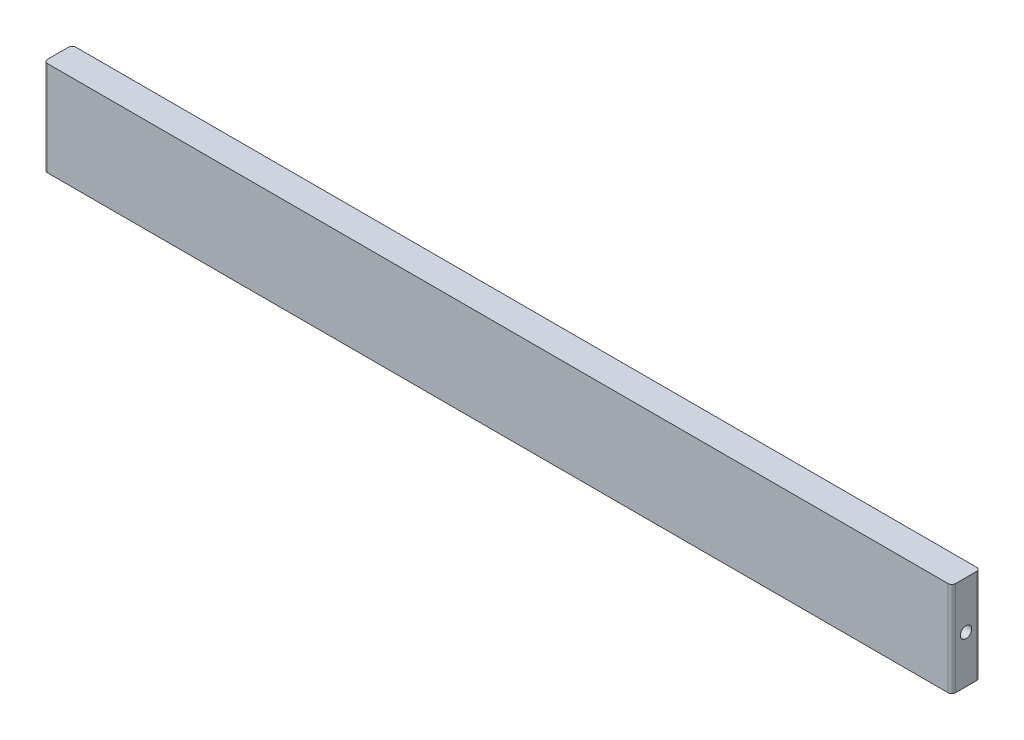
ISO-10303-21;
HEADER;
FILE_DESCRIPTION(('STEP AP214'),'2;1');
FILE_NAME('part.step','',(''),(''),'','','');
FILE_SCHEMA(('AUTOMOTIVE_DESIGN { 1 0 10303 214 1 1 1 1 }'));
ENDSEC;
DATA;
#1=APPLICATION_CONTEXT('core data for automotive mechanical design processes');
#2=APPLICATION_PROTOCOL_DEFINITION('international standard','automotive_design',2000,#1);
#3=PRODUCT_CONTEXT('',#1,'mechanical');
#4=PRODUCT('Part','Part','',(#3));
#5=PRODUCT_RELATED_PRODUCT_CATEGORY('part','',(#4));
#6=PRODUCT_DEFINITION_FORMATION('','',#4);
#7=PRODUCT_DEFINITION_CONTEXT('part definition',#1,'design');
#8=PRODUCT_DEFINITION('design','',#6,#7);
#9=PRODUCT_DEFINITION_SHAPE('','',#8);
#10=(LENGTH_UNIT() NAMED_UNIT(*) SI_UNIT(.MILLI.,.METRE.));
#11=(NAMED_UNIT(*) PLANE_ANGLE_UNIT() SI_UNIT($,.RADIAN.));
#12=(NAMED_UNIT(*) SI_UNIT($,.STERADIAN.) SOLID_ANGLE_UNIT());
#13=UNCERTAINTY_MEASURE_WITH_UNIT(LENGTH_MEASURE(1.E-05),#10,'distance_accuracy_value','');
#14=(GEOMETRIC_REPRESENTATION_CONTEXT(3) GLOBAL_UNCERTAINTY_ASSIGNED_CONTEXT((#13)) GLOBAL_UNIT_ASSIGNED_CONTEXT((#10,
#11,#12)) REPRESENTATION_CONTEXT('',''));
#15=CARTESIAN_POINT('',(0.,0.,0.));
#16=DIRECTION('',(0.,0.,1.));
#17=DIRECTION('',(1.,0.,0.));
#18=AXIS2_PLACEMENT_3D('',#15,#16,#17);
#19=CARTESIAN_POINT('',(0.,10.75,170.));
#20=DIRECTION('',(0.,0.,-1.));
#21=DIRECTION('',(-1.,0.,0.));
#22=AXIS2_PLACEMENT_3D('',#19,#20,#21);
#23=PLANE('',#22);
#24=DIRECTION('',(1.,0.,0.));
#25=VECTOR('',#24,1.);
#26=CARTESIAN_POINT('',(0.,10.75,170.));
#27=LINE('',#26,#25);
#28=CARTESIAN_POINT('',(-151.129999330971,10.75,170.));
#29=VERTEX_POINT('',#28);
#30=CARTESIAN_POINT('',(151.13000066903,10.75,170.));
#31=VERTEX_POINT('',#30);
#32=EDGE_CURVE('E228',#29,#31,#27,.T.);
#33=ORIENTED_EDGE('',*,*,#32,.T.);
#34=DIRECTION('',(0.,-1.,0.));
#35=VECTOR('',#34,1.);
#36=CARTESIAN_POINT('',(151.13000066903,-21.,170.));
#37=LINE('',#36,#35);
#38=CARTESIAN_POINT('',(151.13000066903,-21.,170.));
#39=VERTEX_POINT('',#38);
#40=EDGE_CURVE('E250',#31,#39,#37,.T.);
#41=ORIENTED_EDGE('',*,*,#40,.T.);
#42=DIRECTION('',(1.,0.,0.));
#43=VECTOR('',#42,1.);
#44=CARTESIAN_POINT('',(0.,-21.,170.));
#45=LINE('',#44,#43);
#46=CARTESIAN_POINT('',(-151.129999330971,-21.,170.));
#47=VERTEX_POINT('',#46);
#48=EDGE_CURVE('E227',#47,#39,#45,.T.);
#49=ORIENTED_EDGE('',*,*,#48,.F.);
#50=DIRECTION('',(0.,-1.,0.));
#51=VECTOR('',#50,1.);
#52=CARTESIAN_POINT('',(-151.129999330971,10.75,170.));
#53=LINE('',#52,#51);
#54=EDGE_CURVE('E239',#47,#29,#53,.F.);
#55=ORIENTED_EDGE('',*,*,#54,.T.);
#56=EDGE_LOOP('',(#33,#41,#49,#55));
#57=FACE_BOUND('',#56,.T.);
#58=ADVANCED_FACE('F99',(#57),#23,.T.);
#59=CARTESIAN_POINT('',(-152.39999933097,10.75,0.));
#60=DIRECTION('',(1.,0.,0.));
#61=DIRECTION('',(0.,0.,-1.));
#62=AXIS2_PLACEMENT_3D('',#59,#60,#61);
#63=PLANE('',#62);
#64=CARTESIAN_POINT('',(-152.40000066903,-5.12499999999997,174.7625));
#65=DIRECTION('',(-1.,0.,0.));
#66=DIRECTION('',(0.,0.,1.));
#67=AXIS2_PLACEMENT_3D('',#64,#65,#66);
#68=CIRCLE('',#67,1.89864999999999);
#69=CARTESIAN_POINT('',(-152.40000066903,-5.12499999999997,176.66115));
#70=VERTEX_POINT('',#69);
#71=EDGE_CURVE('E193',#70,#70,#68,.T.);
#72=ORIENTED_EDGE('',*,*,#71,.F.);
#73=EDGE_LOOP('',(#72));
#74=FACE_BOUND('',#73,.T.);
#75=DIRECTION('',(0.,0.,1.));
#76=VECTOR('',#75,1.);
#77=CARTESIAN_POINT('',(-152.39999933097,10.75,0.));
#78=LINE('',#77,#76);
#79=CARTESIAN_POINT('',(-152.399999330971,10.75,171.27));
#80=VERTEX_POINT('',#79);
#81=CARTESIAN_POINT('',(-152.399999330971,10.75,178.255));
#82=VERTEX_POINT('',#81);
#83=EDGE_CURVE('E231',#80,#82,#78,.T.);
#84=ORIENTED_EDGE('',*,*,#83,.F.);
#85=DIRECTION('',(0.,-1.,0.));
#86=VECTOR('',#85,1.);
#87=CARTESIAN_POINT('',(-152.399999330971,-21.,171.27));
#88=LINE('',#87,#86);
#89=CARTESIAN_POINT('',(-152.399999330971,-21.,171.27));
#90=VERTEX_POINT('',#89);
#91=EDGE_CURVE('E12',#80,#90,#88,.T.);
#92=ORIENTED_EDGE('',*,*,#91,.T.);
#93=DIRECTION('',(0.,0.,1.));
#94=VECTOR('',#93,1.);
#95=CARTESIAN_POINT('',(-152.39999933097,-21.,0.));
#96=LINE('',#95,#94);
#97=CARTESIAN_POINT('',(-152.399999330971,-21.,178.255));
#98=VERTEX_POINT('',#97);
#99=EDGE_CURVE('E242',#90,#98,#96,.T.);
#100=ORIENTED_EDGE('',*,*,#99,.T.);
#101=DIRECTION('',(0.,-1.,0.));
#102=VECTOR('',#101,1.);
#103=CARTESIAN_POINT('',(-152.399999330971,10.75,178.255));
#104=LINE('',#103,#102);
#105=EDGE_CURVE('E107',#98,#82,#104,.F.);
#106=ORIENTED_EDGE('',*,*,#105,.T.);
#107=EDGE_LOOP('',(#84,#92,#100,#106));
#108=FACE_BOUND('',#107,.T.);
#109=ADVANCED_FACE('F279',(#74,#108),#63,.F.);
#110=CARTESIAN_POINT('',(0.,10.75,179.525));
#111=DIRECTION('',(0.,0.,-1.));
#112=DIRECTION('',(-1.,0.,0.));
#113=AXIS2_PLACEMENT_3D('',#110,#111,#112);
#114=PLANE('',#113);
#115=DIRECTION('',(1.,0.,0.));
#116=VECTOR('',#115,1.);
#117=CARTESIAN_POINT('',(0.,-21.,179.525));
#118=LINE('',#117,#116);
#119=CARTESIAN_POINT('',(-151.129999330971,-21.,179.525));
#120=VERTEX_POINT('',#119);
#121=CARTESIAN_POINT('',(151.13000066903,-21.,179.525));
#122=VERTEX_POINT('',#121);
#123=EDGE_CURVE('E245',#120,#122,#118,.T.);
#124=ORIENTED_EDGE('',*,*,#123,.T.);
#125=DIRECTION('',(0.,-1.,0.));
#126=VECTOR('',#125,1.);
#127=CARTESIAN_POINT('',(151.13000066903,10.75,179.525));
#128=LINE('',#127,#126);
#129=CARTESIAN_POINT('',(151.13000066903,10.75,179.525));
#130=VERTEX_POINT('',#129);
#131=EDGE_CURVE('E114',#122,#130,#128,.F.);
#132=ORIENTED_EDGE('',*,*,#131,.T.);
#133=DIRECTION('',(1.,0.,0.));
#134=VECTOR('',#133,1.);
#135=CARTESIAN_POINT('',(0.,10.75,179.525));
#136=LINE('',#135,#134);
#137=CARTESIAN_POINT('',(-151.129999330971,10.75,179.525));
#138=VERTEX_POINT('',#137);
#139=EDGE_CURVE('E234',#138,#130,#136,.T.);
#140=ORIENTED_EDGE('',*,*,#139,.F.);
#141=DIRECTION('',(0.,-1.,0.));
#142=VECTOR('',#141,1.);
#143=CARTESIAN_POINT('',(-151.129999330971,10.75,179.525));
#144=LINE('',#143,#142);
#145=EDGE_CURVE('E273',#138,#120,#144,.T.);
#146=ORIENTED_EDGE('',*,*,#145,.T.);
#147=EDGE_LOOP('',(#124,#132,#140,#146));
#148=FACE_BOUND('',#147,.T.);
#149=ADVANCED_FACE('F288',(#148),#114,.F.);
#150=CARTESIAN_POINT('',(152.40000066903,10.75,0.));
#151=DIRECTION('',(-1.,0.,0.));
#152=DIRECTION('',(0.,0.,1.));
#153=AXIS2_PLACEMENT_3D('',#150,#151,#152);
#154=PLANE('',#153);
#155=CARTESIAN_POINT('',(152.40000066903,-5.12499999999997,174.7625));
#156=DIRECTION('',(1.,0.,0.));
#157=DIRECTION('',(0.,0.,-1.));
#158=AXIS2_PLACEMENT_3D('',#155,#156,#157);
#159=CIRCLE('',#158,1.89864999999999);
#160=CARTESIAN_POINT('',(152.40000066903,-5.12499999999997,172.86385));
#161=VERTEX_POINT('',#160);
#162=EDGE_CURVE('E192',#161,#161,#159,.T.);
#163=ORIENTED_EDGE('',*,*,#162,.F.);
#164=EDGE_LOOP('',(#163));
#165=FACE_BOUND('',#164,.T.);
#166=DIRECTION('',(0.,0.,-1.));
#167=VECTOR('',#166,1.);
#168=CARTESIAN_POINT('',(152.40000066903,-21.,0.));
#169=LINE('',#168,#167);
#170=CARTESIAN_POINT('',(152.40000066903,-21.,178.255));
#171=VERTEX_POINT('',#170);
#172=CARTESIAN_POINT('',(152.40000066903,-21.,171.27));
#173=VERTEX_POINT('',#172);
#174=EDGE_CURVE('E232',#171,#173,#169,.T.);
#175=ORIENTED_EDGE('',*,*,#174,.T.);
#176=DIRECTION('',(0.,-1.,0.));
#177=VECTOR('',#176,1.);
#178=CARTESIAN_POINT('',(152.40000066903,10.75,171.27));
#179=LINE('',#178,#177);
#180=CARTESIAN_POINT('',(152.40000066903,10.75,171.27));
#181=VERTEX_POINT('',#180);
#182=EDGE_CURVE('E264',#173,#181,#179,.F.);
#183=ORIENTED_EDGE('',*,*,#182,.T.);
#184=DIRECTION('',(0.,0.,-1.));
#185=VECTOR('',#184,1.);
#186=CARTESIAN_POINT('',(152.40000066903,10.75,0.));
#187=LINE('',#186,#185);
#188=CARTESIAN_POINT('',(152.40000066903,10.75,178.255));
#189=VERTEX_POINT('',#188);
#190=EDGE_CURVE('E236',#189,#181,#187,.T.);
#191=ORIENTED_EDGE('',*,*,#190,.F.);
#192=DIRECTION('',(0.,-1.,0.));
#193=VECTOR('',#192,1.);
#194=CARTESIAN_POINT('',(152.40000066903,10.75,178.255));
#195=LINE('',#194,#193);
#196=EDGE_CURVE('E261',#189,#171,#195,.T.);
#197=ORIENTED_EDGE('',*,*,#196,.T.);
#198=EDGE_LOOP('',(#175,#183,#191,#197));
#199=FACE_BOUND('',#198,.T.);
#200=ADVANCED_FACE('F298',(#165,#199),#154,.F.);
#201=CARTESIAN_POINT('',(0.,10.75,0.));
#202=DIRECTION('',(0.,1.,0.));
#203=DIRECTION('',(0.,0.,1.));
#204=AXIS2_PLACEMENT_3D('',#201,#202,#203);
#205=PLANE('',#204);
#206=ORIENTED_EDGE('',*,*,#190,.T.);
#207=CARTESIAN_POINT('',(151.13000066903,10.75,171.27));
#208=DIRECTION('',(0.,1.,0.));
#209=DIRECTION('',(0.,0.,1.));
#210=AXIS2_PLACEMENT_3D('',#207,#208,#209);
#211=CIRCLE('',#210,1.27);
#212=EDGE_CURVE('E271',#181,#31,#211,.T.);
#213=ORIENTED_EDGE('',*,*,#212,.T.);
#214=ORIENTED_EDGE('',*,*,#32,.F.);
#215=CARTESIAN_POINT('',(-151.129999330971,10.75,171.27));
#216=DIRECTION('',(0.,1.,0.));
#217=DIRECTION('',(0.,0.,1.));
#218=AXIS2_PLACEMENT_3D('',#215,#216,#217);
#219=CIRCLE('',#218,1.27);
#220=EDGE_CURVE('E267',#29,#80,#219,.T.);
#221=ORIENTED_EDGE('',*,*,#220,.T.);
#222=ORIENTED_EDGE('',*,*,#83,.T.);
#223=CARTESIAN_POINT('',(-151.129999330971,10.75,178.255));
#224=DIRECTION('',(0.,1.,0.));
#225=DIRECTION('',(0.,0.,1.));
#226=AXIS2_PLACEMENT_3D('',#223,#224,#225);
#227=CIRCLE('',#226,1.27);
#228=EDGE_CURVE('E121',#82,#138,#227,.T.);
#229=ORIENTED_EDGE('',*,*,#228,.T.);
#230=ORIENTED_EDGE('',*,*,#139,.T.);
#231=CARTESIAN_POINT('',(151.13000066903,10.75,178.255));
#232=DIRECTION('',(0.,1.,0.));
#233=DIRECTION('',(0.,0.,1.));
#234=AXIS2_PLACEMENT_3D('',#231,#232,#233);
#235=CIRCLE('',#234,1.27);
#236=EDGE_CURVE('E269',#130,#189,#235,.T.);
#237=ORIENTED_EDGE('',*,*,#236,.T.);
#238=EDGE_LOOP('',(#206,#213,#214,#221,#222,#229,#230,#237));
#239=FACE_BOUND('',#238,.T.);
#240=ADVANCED_FACE('F283',(#239),#205,.T.);
#241=CARTESIAN_POINT('',(0.,-21.,0.));
#242=DIRECTION('',(0.,1.,0.));
#243=DIRECTION('',(0.,0.,1.));
#244=AXIS2_PLACEMENT_3D('',#241,#242,#243);
#245=PLANE('',#244);
#246=CARTESIAN_POINT('',(127.00000066903,-21.,174.7625));
#247=DIRECTION('',(0.,-1.,0.));
#248=DIRECTION('',(0.,0.,-1.));
#249=AXIS2_PLACEMENT_3D('',#246,#247,#248);
#250=CIRCLE('',#249,1.89865);
#251=CARTESIAN_POINT('',(127.00000066903,-21.,172.86385));
#252=VERTEX_POINT('',#251);
#253=EDGE_CURVE('E203',#252,#252,#250,.T.);
#254=ORIENTED_EDGE('',*,*,#253,.F.);
#255=EDGE_LOOP('',(#254));
#256=FACE_BOUND('',#255,.T.);
#257=CARTESIAN_POINT('',(42.333334002363,-21.,174.7625));
#258=DIRECTION('',(0.,-1.,0.));
#259=DIRECTION('',(0.,0.,-1.));
#260=AXIS2_PLACEMENT_3D('',#257,#258,#259);
#261=CIRCLE('',#260,1.89864999999999);
#262=CARTESIAN_POINT('',(42.333334002363,-21.,172.86385));
#263=VERTEX_POINT('',#262);
#264=EDGE_CURVE('E209',#263,#263,#261,.T.);
#265=ORIENTED_EDGE('',*,*,#264,.F.);
#266=EDGE_LOOP('',(#265));
#267=FACE_BOUND('',#266,.T.);
#268=CARTESIAN_POINT('',(-126.99999933097,-21.,174.7625));
#269=DIRECTION('',(0.,-1.,0.));
#270=DIRECTION('',(0.,0.,-1.));
#271=AXIS2_PLACEMENT_3D('',#268,#269,#270);
#272=CIRCLE('',#271,1.89865);
#273=CARTESIAN_POINT('',(-126.99999933097,-21.,172.86385));
#274=VERTEX_POINT('',#273);
#275=EDGE_CURVE('E215',#274,#274,#272,.T.);
#276=ORIENTED_EDGE('',*,*,#275,.F.);
#277=EDGE_LOOP('',(#276));
#278=FACE_BOUND('',#277,.T.);
#279=CARTESIAN_POINT('',(-42.3333326643037,-21.,174.7625));
#280=DIRECTION('',(0.,-1.,0.));
#281=DIRECTION('',(0.,0.,-1.));
#282=AXIS2_PLACEMENT_3D('',#279,#280,#281);
#283=CIRCLE('',#282,1.89864999999999);
#284=CARTESIAN_POINT('',(-42.3333326643037,-21.,172.86385));
#285=VERTEX_POINT('',#284);
#286=EDGE_CURVE('E221',#285,#285,#283,.T.);
#287=ORIENTED_EDGE('',*,*,#286,.F.);
#288=EDGE_LOOP('',(#287));
#289=FACE_BOUND('',#288,.T.);
#290=ORIENTED_EDGE('',*,*,#48,.T.);
#291=CARTESIAN_POINT('',(151.13000066903,-21.,171.27));
#292=DIRECTION('',(0.,1.,0.));
#293=DIRECTION('',(0.,0.,1.));
#294=AXIS2_PLACEMENT_3D('',#291,#292,#293);
#295=CIRCLE('',#294,1.27);
#296=EDGE_CURVE('E259',#39,#173,#295,.F.);
#297=ORIENTED_EDGE('',*,*,#296,.T.);
#298=ORIENTED_EDGE('',*,*,#174,.F.);
#299=CARTESIAN_POINT('',(151.13000066903,-21.,178.255));
#300=DIRECTION('',(0.,1.,0.));
#301=DIRECTION('',(0.,0.,1.));
#302=AXIS2_PLACEMENT_3D('',#299,#300,#301);
#303=CIRCLE('',#302,1.27);
#304=EDGE_CURVE('E257',#171,#122,#303,.F.);
#305=ORIENTED_EDGE('',*,*,#304,.T.);
#306=ORIENTED_EDGE('',*,*,#123,.F.);
#307=CARTESIAN_POINT('',(-151.129999330971,-21.,178.255));
#308=DIRECTION('',(0.,1.,0.));
#309=DIRECTION('',(0.,0.,1.));
#310=AXIS2_PLACEMENT_3D('',#307,#308,#309);
#311=CIRCLE('',#310,1.27);
#312=EDGE_CURVE('E253',#120,#98,#311,.F.);
#313=ORIENTED_EDGE('',*,*,#312,.T.);
#314=ORIENTED_EDGE('',*,*,#99,.F.);
#315=CARTESIAN_POINT('',(-151.129999330971,-21.,171.27));
#316=DIRECTION('',(0.,1.,0.));
#317=DIRECTION('',(0.,0.,1.));
#318=AXIS2_PLACEMENT_3D('',#315,#316,#317);
#319=CIRCLE('',#318,1.27);
#320=EDGE_CURVE('E255',#90,#47,#319,.F.);
#321=ORIENTED_EDGE('',*,*,#320,.T.);
#322=EDGE_LOOP('',(#290,#297,#298,#305,#306,#313,#314,#321));
#323=FACE_BOUND('',#322,.T.);
#324=ADVANCED_FACE('F290',(#256,#267,#278,#289,#323),#245,.F.);
#325=CARTESIAN_POINT('',(-42.3333326643037,-1.94999999999997,174.7625));
#326=DIRECTION('',(0.,-1.,0.));
#327=DIRECTION('',(0.,0.,-1.));
#328=AXIS2_PLACEMENT_3D('',#325,#326,#327);
#329=CONICAL_SURFACE('',#328,1.89864999999999,1.02974425867665);
#330=CARTESIAN_POINT('',(-42.3333326643037,-0.809175985683294,174.7625));
#331=VERTEX_POINT('',#330);
#332=VERTEX_LOOP('',#331);
#333=FACE_BOUND('',#332,.T.);
#334=CARTESIAN_POINT('',(-42.3333326643037,-1.94999999999997,174.7625));
#335=DIRECTION('',(0.,-1.,0.));
#336=DIRECTION('',(0.,0.,-1.));
#337=AXIS2_PLACEMENT_3D('',#334,#335,#336);
#338=CIRCLE('',#337,1.89864999999999);
#339=CARTESIAN_POINT('',(-42.3333326643037,-1.94999999999997,172.86385));
#340=VERTEX_POINT('',#339);
#341=EDGE_CURVE('E224',#340,#340,#338,.T.);
#342=ORIENTED_EDGE('',*,*,#341,.T.);
#343=EDGE_LOOP('',(#342));
#344=FACE_BOUND('',#343,.T.);
#345=ADVANCED_FACE('F369',(#333,#344),#329,.F.);
#346=CARTESIAN_POINT('',(-42.3333326643037,-21.,174.7625));
#347=DIRECTION('',(0.,-1.,0.));
#348=DIRECTION('',(0.,0.,-1.));
#349=AXIS2_PLACEMENT_3D('',#346,#347,#348);
#350=CYLINDRICAL_SURFACE('',#349,1.89864999999999);
#351=ORIENTED_EDGE('',*,*,#341,.F.);
#352=EDGE_LOOP('',(#351));
#353=FACE_BOUND('',#352,.T.);
#354=ORIENTED_EDGE('',*,*,#286,.T.);
#355=EDGE_LOOP('',(#354));
#356=FACE_BOUND('',#355,.T.);
#357=ADVANCED_FACE('F365',(#353,#356),#350,.F.);
#358=CARTESIAN_POINT('',(-126.99999933097,-1.94999999999997,174.7625));
#359=DIRECTION('',(0.,-1.,0.));
#360=DIRECTION('',(0.,0.,-1.));
#361=AXIS2_PLACEMENT_3D('',#358,#359,#360);
#362=CONICAL_SURFACE('',#361,1.89865,1.02974425867665);
#363=CARTESIAN_POINT('',(-126.99999933097,-0.809175985683294,174.7625));
#364=VERTEX_POINT('',#363);
#365=VERTEX_LOOP('',#364);
#366=FACE_BOUND('',#365,.T.);
#367=CARTESIAN_POINT('',(-126.99999933097,-1.94999999999997,174.7625));
#368=DIRECTION('',(0.,-1.,0.));
#369=DIRECTION('',(0.,0.,-1.));
#370=AXIS2_PLACEMENT_3D('',#367,#368,#369);
#371=CIRCLE('',#370,1.89865);
#372=CARTESIAN_POINT('',(-126.99999933097,-1.94999999999997,172.86385));
#373=VERTEX_POINT('',#372);
#374=EDGE_CURVE('E218',#373,#373,#371,.T.);
#375=ORIENTED_EDGE('',*,*,#374,.T.);
#376=EDGE_LOOP('',(#375));
#377=FACE_BOUND('',#376,.T.);
#378=ADVANCED_FACE('F361',(#366,#377),#362,.F.);
#379=CARTESIAN_POINT('',(-126.99999933097,-21.,174.7625));
#380=DIRECTION('',(0.,-1.,0.));
#381=DIRECTION('',(0.,0.,-1.));
#382=AXIS2_PLACEMENT_3D('',#379,#380,#381);
#383=CYLINDRICAL_SURFACE('',#382,1.89865);
#384=ORIENTED_EDGE('',*,*,#374,.F.);
#385=EDGE_LOOP('',(#384));
#386=FACE_BOUND('',#385,.T.);
#387=ORIENTED_EDGE('',*,*,#275,.T.);
#388=EDGE_LOOP('',(#387));
#389=FACE_BOUND('',#388,.T.);
#390=ADVANCED_FACE('F357',(#386,#389),#383,.F.);
#391=CARTESIAN_POINT('',(42.333334002363,-1.94999999999997,174.7625));
#392=DIRECTION('',(0.,-1.,0.));
#393=DIRECTION('',(0.,0.,-1.));
#394=AXIS2_PLACEMENT_3D('',#391,#392,#393);
#395=CONICAL_SURFACE('',#394,1.89864999999999,1.02974425867665);
#396=CARTESIAN_POINT('',(42.333334002363,-0.809175985683294,174.7625));
#397=VERTEX_POINT('',#396);
#398=VERTEX_LOOP('',#397);
#399=FACE_BOUND('',#398,.T.);
#400=CARTESIAN_POINT('',(42.333334002363,-1.94999999999997,174.7625));
#401=DIRECTION('',(0.,-1.,0.));
#402=DIRECTION('',(0.,0.,-1.));
#403=AXIS2_PLACEMENT_3D('',#400,#401,#402);
#404=CIRCLE('',#403,1.89864999999999);
#405=CARTESIAN_POINT('',(42.333334002363,-1.94999999999997,172.86385));
#406=VERTEX_POINT('',#405);
#407=EDGE_CURVE('E212',#406,#406,#404,.T.);
#408=ORIENTED_EDGE('',*,*,#407,.T.);
#409=EDGE_LOOP('',(#408));
#410=FACE_BOUND('',#409,.T.);
#411=ADVANCED_FACE('F353',(#399,#410),#395,.F.);
#412=CARTESIAN_POINT('',(42.333334002363,-21.,174.7625));
#413=DIRECTION('',(0.,-1.,0.));
#414=DIRECTION('',(0.,0.,-1.));
#415=AXIS2_PLACEMENT_3D('',#412,#413,#414);
#416=CYLINDRICAL_SURFACE('',#415,1.89864999999999);
#417=ORIENTED_EDGE('',*,*,#407,.F.);
#418=EDGE_LOOP('',(#417));
#419=FACE_BOUND('',#418,.T.);
#420=ORIENTED_EDGE('',*,*,#264,.T.);
#421=EDGE_LOOP('',(#420));
#422=FACE_BOUND('',#421,.T.);
#423=ADVANCED_FACE('F349',(#419,#422),#416,.F.);
#424=CARTESIAN_POINT('',(127.00000066903,-1.94999999999997,174.7625));
#425=DIRECTION('',(0.,-1.,0.));
#426=DIRECTION('',(0.,0.,-1.));
#427=AXIS2_PLACEMENT_3D('',#424,#425,#426);
#428=CONICAL_SURFACE('',#427,1.89865,1.02974425867665);
#429=CARTESIAN_POINT('',(127.00000066903,-0.809175985683294,174.7625));
#430=VERTEX_POINT('',#429);
#431=VERTEX_LOOP('',#430);
#432=FACE_BOUND('',#431,.T.);
#433=CARTESIAN_POINT('',(127.00000066903,-1.94999999999997,174.7625));
#434=DIRECTION('',(0.,-1.,0.));
#435=DIRECTION('',(0.,0.,-1.));
#436=AXIS2_PLACEMENT_3D('',#433,#434,#435);
#437=CIRCLE('',#436,1.89865);
#438=CARTESIAN_POINT('',(127.00000066903,-1.94999999999997,172.86385));
#439=VERTEX_POINT('',#438);
#440=EDGE_CURVE('E206',#439,#439,#437,.T.);
#441=ORIENTED_EDGE('',*,*,#440,.T.);
#442=EDGE_LOOP('',(#441));
#443=FACE_BOUND('',#442,.T.);
#444=ADVANCED_FACE('F345',(#432,#443),#428,.F.);
#445=CARTESIAN_POINT('',(127.00000066903,-21.,174.7625));
#446=DIRECTION('',(0.,-1.,0.));
#447=DIRECTION('',(0.,0.,-1.));
#448=AXIS2_PLACEMENT_3D('',#445,#446,#447);
#449=CYLINDRICAL_SURFACE('',#448,1.89865);
#450=ORIENTED_EDGE('',*,*,#440,.F.);
#451=EDGE_LOOP('',(#450));
#452=FACE_BOUND('',#451,.T.);
#453=ORIENTED_EDGE('',*,*,#253,.T.);
#454=EDGE_LOOP('',(#453));
#455=FACE_BOUND('',#454,.T.);
#456=ADVANCED_FACE('F341',(#452,#455),#449,.F.);
#457=CARTESIAN_POINT('',(133.35000066903,-5.12499999999997,174.7625));
#458=DIRECTION('',(1.,0.,0.));
#459=DIRECTION('',(0.,0.,-1.));
#460=AXIS2_PLACEMENT_3D('',#457,#458,#459);
#461=CONICAL_SURFACE('',#460,1.89864999999999,1.02974425867664);
#462=CARTESIAN_POINT('',(132.209176654713,-5.12499999999998,174.7625));
#463=VERTEX_POINT('',#462);
#464=VERTEX_LOOP('',#463);
#465=FACE_BOUND('',#464,.T.);
#466=CARTESIAN_POINT('',(133.35000066903,-5.12499999999997,174.7625));
#467=DIRECTION('',(1.,0.,0.));
#468=DIRECTION('',(0.,0.,-1.));
#469=AXIS2_PLACEMENT_3D('',#466,#467,#468);
#470=CIRCLE('',#469,1.89864999999999);
#471=CARTESIAN_POINT('',(133.35000066903,-5.12499999999997,172.86385));
#472=VERTEX_POINT('',#471);
#473=EDGE_CURVE('E196',#472,#472,#470,.T.);
#474=ORIENTED_EDGE('',*,*,#473,.T.);
#475=EDGE_LOOP('',(#474));
#476=FACE_BOUND('',#475,.T.);
#477=ADVANCED_FACE('F337',(#465,#476),#461,.F.);
#478=CARTESIAN_POINT('',(152.40000066903,-5.12499999999997,174.7625));
#479=DIRECTION('',(1.,0.,0.));
#480=DIRECTION('',(0.,0.,-1.));
#481=AXIS2_PLACEMENT_3D('',#478,#479,#480);
#482=CYLINDRICAL_SURFACE('',#481,1.89864999999999);
#483=ORIENTED_EDGE('',*,*,#473,.F.);
#484=EDGE_LOOP('',(#483));
#485=FACE_BOUND('',#484,.T.);
#486=ORIENTED_EDGE('',*,*,#162,.T.);
#487=EDGE_LOOP('',(#486));
#488=FACE_BOUND('',#487,.T.);
#489=ADVANCED_FACE('F186',(#485,#488),#482,.F.);
#490=CARTESIAN_POINT('',(-133.35000066903,-5.12499999999997,174.7625));
#491=DIRECTION('',(-1.,0.,0.));
#492=DIRECTION('',(0.,0.,1.));
#493=AXIS2_PLACEMENT_3D('',#490,#491,#492);
#494=CONICAL_SURFACE('',#493,1.89864999999999,1.02974425867664);
#495=CARTESIAN_POINT('',(-132.209176654713,-5.12499999999998,174.7625));
#496=VERTEX_POINT('',#495);
#497=VERTEX_LOOP('',#496);
#498=FACE_BOUND('',#497,.T.);
#499=CARTESIAN_POINT('',(-133.35000066903,-5.12499999999997,174.7625));
#500=DIRECTION('',(-1.,0.,0.));
#501=DIRECTION('',(0.,0.,1.));
#502=AXIS2_PLACEMENT_3D('',#499,#500,#501);
#503=CIRCLE('',#502,1.89864999999999);
#504=CARTESIAN_POINT('',(-133.35000066903,-5.12499999999997,176.66115));
#505=VERTEX_POINT('',#504);
#506=EDGE_CURVE('E190',#505,#505,#503,.T.);
#507=ORIENTED_EDGE('',*,*,#506,.T.);
#508=EDGE_LOOP('',(#507));
#509=FACE_BOUND('',#508,.T.);
#510=ADVANCED_FACE('F182',(#498,#509),#494,.F.);
#511=CARTESIAN_POINT('',(-152.40000066903,-5.12499999999997,174.7625));
#512=DIRECTION('',(-1.,0.,0.));
#513=DIRECTION('',(0.,0.,1.));
#514=AXIS2_PLACEMENT_3D('',#511,#512,#513);
#515=CYLINDRICAL_SURFACE('',#514,1.89864999999999);
#516=ORIENTED_EDGE('',*,*,#506,.F.);
#517=EDGE_LOOP('',(#516));
#518=FACE_BOUND('',#517,.T.);
#519=ORIENTED_EDGE('',*,*,#71,.T.);
#520=EDGE_LOOP('',(#519));
#521=FACE_BOUND('',#520,.T.);
#522=ADVANCED_FACE('F185',(#518,#521),#515,.F.);
#523=CARTESIAN_POINT('',(151.13000066903,10.75,171.27));
#524=DIRECTION('',(0.,1.,0.));
#525=DIRECTION('',(0.,0.,1.));
#526=AXIS2_PLACEMENT_3D('',#523,#524,#525);
#527=CYLINDRICAL_SURFACE('',#526,1.27);
#528=ORIENTED_EDGE('',*,*,#212,.F.);
#529=ORIENTED_EDGE('',*,*,#182,.F.);
#530=ORIENTED_EDGE('',*,*,#296,.F.);
#531=ORIENTED_EDGE('',*,*,#40,.F.);
#532=EDGE_LOOP('',(#528,#529,#530,#531));
#533=FACE_BOUND('',#532,.T.);
#534=ADVANCED_FACE('F303',(#533),#527,.T.);
#535=CARTESIAN_POINT('',(151.13000066903,10.75,178.255));
#536=DIRECTION('',(0.,-1.,0.));
#537=DIRECTION('',(0.,0.,-1.));
#538=AXIS2_PLACEMENT_3D('',#535,#536,#537);
#539=CYLINDRICAL_SURFACE('',#538,1.27);
#540=ORIENTED_EDGE('',*,*,#236,.F.);
#541=ORIENTED_EDGE('',*,*,#131,.F.);
#542=ORIENTED_EDGE('',*,*,#304,.F.);
#543=ORIENTED_EDGE('',*,*,#196,.F.);
#544=EDGE_LOOP('',(#540,#541,#542,#543));
#545=FACE_BOUND('',#544,.T.);
#546=ADVANCED_FACE('F295',(#545),#539,.T.);
#547=CARTESIAN_POINT('',(-151.129999330971,10.75,171.27));
#548=DIRECTION('',(0.,1.,0.));
#549=DIRECTION('',(0.,0.,1.));
#550=AXIS2_PLACEMENT_3D('',#547,#548,#549);
#551=CYLINDRICAL_SURFACE('',#550,1.27);
#552=ORIENTED_EDGE('',*,*,#220,.F.);
#553=ORIENTED_EDGE('',*,*,#54,.F.);
#554=ORIENTED_EDGE('',*,*,#320,.F.);
#555=ORIENTED_EDGE('',*,*,#91,.F.);
#556=EDGE_LOOP('',(#552,#553,#554,#555));
#557=FACE_BOUND('',#556,.T.);
#558=ADVANCED_FACE('F308',(#557),#551,.T.);
#559=CARTESIAN_POINT('',(-151.129999330971,10.75,178.255));
#560=DIRECTION('',(0.,-1.,0.));
#561=DIRECTION('',(0.,0.,-1.));
#562=AXIS2_PLACEMENT_3D('',#559,#560,#561);
#563=CYLINDRICAL_SURFACE('',#562,1.27);
#564=ORIENTED_EDGE('',*,*,#228,.F.);
#565=ORIENTED_EDGE('',*,*,#105,.F.);
#566=ORIENTED_EDGE('',*,*,#312,.F.);
#567=ORIENTED_EDGE('',*,*,#145,.F.);
#568=EDGE_LOOP('',(#564,#565,#566,#567));
#569=FACE_BOUND('',#568,.T.);
#570=ADVANCED_FACE('F101',(#569),#563,.T.);
#571=CLOSED_SHELL('',(#58,#109,#149,#200,#240,#324,#345,#357,#378,#390,#411,#423,#444,#456,#477,
#489,#510,#522,#534,#546,#558,#570));
#572=MANIFOLD_SOLID_BREP('B2',#571);
#573=ADVANCED_BREP_SHAPE_REPRESENTATION('',(#18,#572),#14);
#574=SHAPE_DEFINITION_REPRESENTATION(#9,#573);
ENDSEC;
END-ISO-10303-21;
